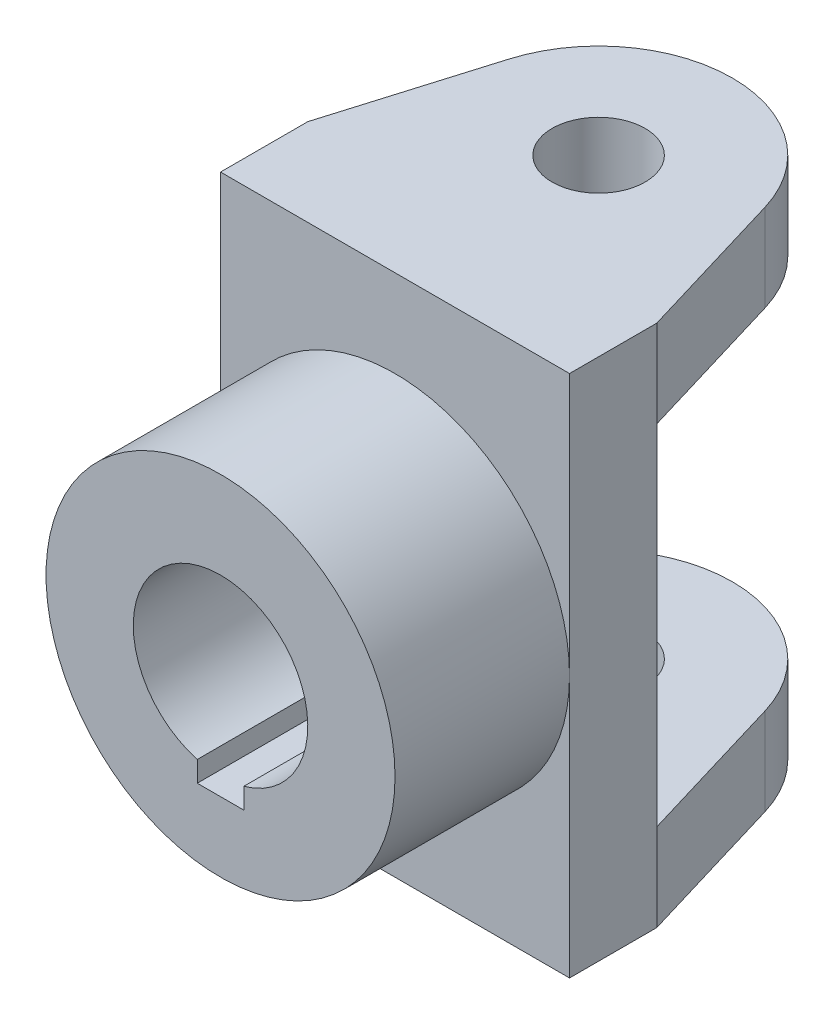
ISO-10303-21;
HEADER;
FILE_DESCRIPTION(('STEP AP214'),'2;1');
FILE_NAME('part.step','',(''),(''),'','','');
FILE_SCHEMA(('AUTOMOTIVE_DESIGN { 1 0 10303 214 1 1 1 1 }'));
ENDSEC;
DATA;
#1=APPLICATION_CONTEXT('core data for automotive mechanical design processes');
#2=APPLICATION_PROTOCOL_DEFINITION('international standard','automotive_design',2000,#1);
#3=PRODUCT_CONTEXT('',#1,'mechanical');
#4=PRODUCT('Part','Part','',(#3));
#5=PRODUCT_RELATED_PRODUCT_CATEGORY('part','',(#4));
#6=PRODUCT_DEFINITION_FORMATION('','',#4);
#7=PRODUCT_DEFINITION_CONTEXT('part definition',#1,'design');
#8=PRODUCT_DEFINITION('design','',#6,#7);
#9=PRODUCT_DEFINITION_SHAPE('','',#8);
#10=(LENGTH_UNIT() NAMED_UNIT(*) SI_UNIT(.MILLI.,.METRE.));
#11=(NAMED_UNIT(*) PLANE_ANGLE_UNIT() SI_UNIT($,.RADIAN.));
#12=(NAMED_UNIT(*) SI_UNIT($,.STERADIAN.) SOLID_ANGLE_UNIT());
#13=UNCERTAINTY_MEASURE_WITH_UNIT(LENGTH_MEASURE(1.E-05),#10,'distance_accuracy_value','');
#14=(GEOMETRIC_REPRESENTATION_CONTEXT(3) GLOBAL_UNCERTAINTY_ASSIGNED_CONTEXT((#13)) GLOBAL_UNIT_ASSIGNED_CONTEXT((#10,
#11,#12)) REPRESENTATION_CONTEXT('',''));
#15=CARTESIAN_POINT('',(0.,0.,0.));
#16=DIRECTION('',(0.,0.,1.));
#17=DIRECTION('',(1.,0.,0.));
#18=AXIS2_PLACEMENT_3D('',#15,#16,#17);
#19=CARTESIAN_POINT('',(0.,0.,0.));
#20=DIRECTION('',(0.,0.,1.));
#21=DIRECTION('',(1.,0.,0.));
#22=AXIS2_PLACEMENT_3D('',#19,#20,#21);
#23=PLANE('',#22);
#24=DIRECTION('',(1.,0.,0.));
#25=VECTOR('',#24,1.);
#26=CARTESIAN_POINT('',(-30.,-30.,0.));
#27=LINE('',#26,#25);
#28=CARTESIAN_POINT('',(-30.,-30.,0.));
#29=VERTEX_POINT('',#28);
#30=CARTESIAN_POINT('',(30.,-30.,0.));
#31=VERTEX_POINT('',#30);
#32=EDGE_CURVE('E156',#29,#31,#27,.T.);
#33=ORIENTED_EDGE('',*,*,#32,.F.);
#34=DIRECTION('',(0.,-1.,0.));
#35=VECTOR('',#34,1.);
#36=CARTESIAN_POINT('',(-30.,45.,0.));
#37=LINE('',#36,#35);
#38=CARTESIAN_POINT('',(-30.,30.,0.));
#39=VERTEX_POINT('',#38);
#40=EDGE_CURVE('E191',#39,#29,#37,.T.);
#41=ORIENTED_EDGE('',*,*,#40,.F.);
#42=DIRECTION('',(1.,0.,0.));
#43=VECTOR('',#42,1.);
#44=CARTESIAN_POINT('',(-30.,30.,0.));
#45=LINE('',#44,#43);
#46=CARTESIAN_POINT('',(30.,30.,0.));
#47=VERTEX_POINT('',#46);
#48=EDGE_CURVE('E182',#39,#47,#45,.T.);
#49=ORIENTED_EDGE('',*,*,#48,.T.);
#50=DIRECTION('',(0.,1.,0.));
#51=VECTOR('',#50,1.);
#52=CARTESIAN_POINT('',(30.,45.,0.));
#53=LINE('',#52,#51);
#54=EDGE_CURVE('E61',#31,#47,#53,.T.);
#55=ORIENTED_EDGE('',*,*,#54,.F.);
#56=EDGE_LOOP('',(#33,#41,#49,#55));
#57=FACE_BOUND('',#56,.T.);
#58=ADVANCED_FACE('F43',(#57),#23,.F.);
#59=CARTESIAN_POINT('',(0.,0.,15.));
#60=DIRECTION('',(0.,0.,1.));
#61=DIRECTION('',(1.,0.,0.));
#62=AXIS2_PLACEMENT_3D('',#59,#60,#61);
#63=PLANE('',#62);
#64=CARTESIAN_POINT('',(0.,0.,15.));
#65=DIRECTION('',(0.,0.,1.));
#66=DIRECTION('',(1.,0.,0.));
#67=AXIS2_PLACEMENT_3D('',#64,#65,#66);
#68=CIRCLE('',#67,30.);
#69=CARTESIAN_POINT('',(30.,0.,15.));
#70=VERTEX_POINT('',#69);
#71=CARTESIAN_POINT('',(-30.,0.,15.));
#72=VERTEX_POINT('',#71);
#73=EDGE_CURVE('E54',#70,#72,#68,.T.);
#74=ORIENTED_EDGE('',*,*,#73,.F.);
#75=DIRECTION('',(0.,1.,0.));
#76=VECTOR('',#75,1.);
#77=CARTESIAN_POINT('',(30.,45.,15.));
#78=LINE('',#77,#76);
#79=CARTESIAN_POINT('',(30.,45.,15.));
#80=VERTEX_POINT('',#79);
#81=EDGE_CURVE('E201',#70,#80,#78,.T.);
#82=ORIENTED_EDGE('',*,*,#81,.T.);
#83=DIRECTION('',(-1.,0.,0.));
#84=VECTOR('',#83,1.);
#85=CARTESIAN_POINT('',(-30.,45.,15.));
#86=LINE('',#85,#84);
#87=CARTESIAN_POINT('',(-30.,45.,15.));
#88=VERTEX_POINT('',#87);
#89=EDGE_CURVE('E223',#80,#88,#86,.T.);
#90=ORIENTED_EDGE('',*,*,#89,.T.);
#91=DIRECTION('',(0.,-1.,0.));
#92=VECTOR('',#91,1.);
#93=CARTESIAN_POINT('',(-30.,45.,15.));
#94=LINE('',#93,#92);
#95=EDGE_CURVE('E293',#88,#72,#94,.T.);
#96=ORIENTED_EDGE('',*,*,#95,.T.);
#97=EDGE_LOOP('',(#74,#82,#90,#96));
#98=FACE_BOUND('',#97,.T.);
#99=ADVANCED_FACE('F384',(#98),#63,.T.);
#100=CARTESIAN_POINT('',(30.,45.,15.));
#101=DIRECTION('',(-1.,0.,0.));
#102=DIRECTION('',(0.,-1.,0.));
#103=AXIS2_PLACEMENT_3D('',#100,#101,#102);
#104=PLANE('',#103);
#105=CARTESIAN_POINT('',(30.,-45.,0.));
#106=VERTEX_POINT('',#105);
#107=EDGE_CURVE('E173',#106,#31,#53,.T.);
#108=ORIENTED_EDGE('',*,*,#107,.T.);
#109=ORIENTED_EDGE('',*,*,#54,.T.);
#110=DIRECTION('',(0.,1.,0.));
#111=VECTOR('',#110,1.);
#112=CARTESIAN_POINT('',(30.,30.,0.));
#113=LINE('',#112,#111);
#114=CARTESIAN_POINT('',(30.,45.,0.));
#115=VERTEX_POINT('',#114);
#116=EDGE_CURVE('E227',#47,#115,#113,.T.);
#117=ORIENTED_EDGE('',*,*,#116,.T.);
#118=DIRECTION('',(0.,0.,-1.));
#119=VECTOR('',#118,1.);
#120=CARTESIAN_POINT('',(30.,45.,15.));
#121=LINE('',#120,#119);
#122=EDGE_CURVE('E47',#80,#115,#121,.T.);
#123=ORIENTED_EDGE('',*,*,#122,.F.);
#124=ORIENTED_EDGE('',*,*,#81,.F.);
#125=CARTESIAN_POINT('',(30.,-45.,15.));
#126=VERTEX_POINT('',#125);
#127=EDGE_CURVE('E288',#126,#70,#78,.T.);
#128=ORIENTED_EDGE('',*,*,#127,.F.);
#129=DIRECTION('',(0.,0.,-1.));
#130=VECTOR('',#129,1.);
#131=CARTESIAN_POINT('',(30.,-45.,15.));
#132=LINE('',#131,#130);
#133=EDGE_CURVE('E189',#126,#106,#132,.T.);
#134=ORIENTED_EDGE('',*,*,#133,.T.);
#135=EDGE_LOOP('',(#108,#109,#117,#123,#124,#128,#134));
#136=FACE_BOUND('',#135,.T.);
#137=ADVANCED_FACE('F45',(#136),#104,.F.);
#138=CARTESIAN_POINT('',(-30.,45.,15.));
#139=DIRECTION('',(0.,-1.,0.));
#140=DIRECTION('',(0.,0.,-1.));
#141=AXIS2_PLACEMENT_3D('',#138,#139,#140);
#142=PLANE('',#141);
#143=ORIENTED_EDGE('',*,*,#122,.T.);
#144=DIRECTION('',(-0.286928155857607,0.,-0.957952103905071));
#145=VECTOR('',#144,1.);
#146=CARTESIAN_POINT('',(30.,45.,0.));
#147=LINE('',#146,#145);
#148=CARTESIAN_POINT('',(22.0328983898167,45.,-26.599347584725));
#149=VERTEX_POINT('',#148);
#150=EDGE_CURVE('E222',#115,#149,#147,.T.);
#151=ORIENTED_EDGE('',*,*,#150,.T.);
#152=CARTESIAN_POINT('',(0.,45.,-20.));
#153=DIRECTION('',(0.,1.,0.));
#154=DIRECTION('',(0.,0.,1.));
#155=AXIS2_PLACEMENT_3D('',#152,#153,#154);
#156=CIRCLE('',#155,23.);
#157=CARTESIAN_POINT('',(-22.0328983898166,45.,-26.599347584725));
#158=VERTEX_POINT('',#157);
#159=EDGE_CURVE('E357',#149,#158,#156,.T.);
#160=ORIENTED_EDGE('',*,*,#159,.T.);
#161=DIRECTION('',(-0.286928155857607,0.,0.957952103905071));
#162=VECTOR('',#161,1.);
#163=CARTESIAN_POINT('',(-30.,45.,0.));
#164=LINE('',#163,#162);
#165=CARTESIAN_POINT('',(-30.,45.,0.));
#166=VERTEX_POINT('',#165);
#167=EDGE_CURVE('E242',#158,#166,#164,.T.);
#168=ORIENTED_EDGE('',*,*,#167,.T.);
#169=DIRECTION('',(0.,0.,-1.));
#170=VECTOR('',#169,1.);
#171=CARTESIAN_POINT('',(-30.,45.,15.));
#172=LINE('',#171,#170);
#173=EDGE_CURVE('E207',#88,#166,#172,.T.);
#174=ORIENTED_EDGE('',*,*,#173,.F.);
#175=ORIENTED_EDGE('',*,*,#89,.F.);
#176=EDGE_LOOP('',(#143,#151,#160,#168,#174,#175));
#177=FACE_BOUND('',#176,.T.);
#178=CARTESIAN_POINT('',(0.,45.,-20.));
#179=DIRECTION('',(0.,1.,0.));
#180=DIRECTION('',(0.,0.,1.));
#181=AXIS2_PLACEMENT_3D('',#178,#179,#180);
#182=CIRCLE('',#181,8.);
#183=CARTESIAN_POINT('',(0.,45.,-12.));
#184=VERTEX_POINT('',#183);
#185=EDGE_CURVE('E330',#184,#184,#182,.T.);
#186=ORIENTED_EDGE('',*,*,#185,.F.);
#187=EDGE_LOOP('',(#186));
#188=FACE_BOUND('',#187,.T.);
#189=ADVANCED_FACE('F219',(#177,#188),#142,.F.);
#190=CARTESIAN_POINT('',(-30.,45.,15.));
#191=DIRECTION('',(1.,0.,0.));
#192=DIRECTION('',(0.,1.,0.));
#193=AXIS2_PLACEMENT_3D('',#190,#191,#192);
#194=PLANE('',#193);
#195=EDGE_CURVE('E193',#166,#39,#37,.T.);
#196=ORIENTED_EDGE('',*,*,#195,.T.);
#197=ORIENTED_EDGE('',*,*,#40,.T.);
#198=DIRECTION('',(0.,-1.,0.));
#199=VECTOR('',#198,1.);
#200=CARTESIAN_POINT('',(-30.,-30.,0.));
#201=LINE('',#200,#199);
#202=CARTESIAN_POINT('',(-30.,-45.,0.));
#203=VERTEX_POINT('',#202);
#204=EDGE_CURVE('E306',#29,#203,#201,.T.);
#205=ORIENTED_EDGE('',*,*,#204,.T.);
#206=DIRECTION('',(0.,0.,-1.));
#207=VECTOR('',#206,1.);
#208=CARTESIAN_POINT('',(-30.,-45.,15.));
#209=LINE('',#208,#207);
#210=CARTESIAN_POINT('',(-30.,-45.,15.));
#211=VERTEX_POINT('',#210);
#212=EDGE_CURVE('E204',#211,#203,#209,.T.);
#213=ORIENTED_EDGE('',*,*,#212,.F.);
#214=EDGE_CURVE('E292',#72,#211,#94,.T.);
#215=ORIENTED_EDGE('',*,*,#214,.F.);
#216=ORIENTED_EDGE('',*,*,#95,.F.);
#217=ORIENTED_EDGE('',*,*,#173,.T.);
#218=EDGE_LOOP('',(#196,#197,#205,#213,#215,#216,#217));
#219=FACE_BOUND('',#218,.T.);
#220=ADVANCED_FACE('F305',(#219),#194,.F.);
#221=CARTESIAN_POINT('',(-30.,-45.,15.));
#222=DIRECTION('',(0.,1.,0.));
#223=DIRECTION('',(0.,0.,1.));
#224=AXIS2_PLACEMENT_3D('',#221,#222,#223);
#225=PLANE('',#224);
#226=ORIENTED_EDGE('',*,*,#212,.T.);
#227=DIRECTION('',(-0.286928155857607,0.,0.957952103905071));
#228=VECTOR('',#227,1.);
#229=CARTESIAN_POINT('',(-30.,-45.,0.));
#230=LINE('',#229,#228);
#231=CARTESIAN_POINT('',(-22.0328983898166,-45.,-26.599347584725));
#232=VERTEX_POINT('',#231);
#233=EDGE_CURVE('E313',#232,#203,#230,.T.);
#234=ORIENTED_EDGE('',*,*,#233,.F.);
#235=CARTESIAN_POINT('',(0.,-45.,-20.));
#236=DIRECTION('',(0.,1.,0.));
#237=DIRECTION('',(0.,0.,1.));
#238=AXIS2_PLACEMENT_3D('',#235,#236,#237);
#239=CIRCLE('',#238,23.);
#240=CARTESIAN_POINT('',(22.0328983898167,-45.,-26.599347584725));
#241=VERTEX_POINT('',#240);
#242=EDGE_CURVE('E178',#241,#232,#239,.T.);
#243=ORIENTED_EDGE('',*,*,#242,.F.);
#244=DIRECTION('',(-0.286928155857607,0.,-0.957952103905071));
#245=VECTOR('',#244,1.);
#246=CARTESIAN_POINT('',(30.,-45.,0.));
#247=LINE('',#246,#245);
#248=EDGE_CURVE('E311',#106,#241,#247,.T.);
#249=ORIENTED_EDGE('',*,*,#248,.F.);
#250=ORIENTED_EDGE('',*,*,#133,.F.);
#251=DIRECTION('',(1.,0.,0.));
#252=VECTOR('',#251,1.);
#253=CARTESIAN_POINT('',(-30.,-45.,15.));
#254=LINE('',#253,#252);
#255=EDGE_CURVE('E196',#211,#126,#254,.T.);
#256=ORIENTED_EDGE('',*,*,#255,.F.);
#257=EDGE_LOOP('',(#226,#234,#243,#249,#250,#256));
#258=FACE_BOUND('',#257,.T.);
#259=CARTESIAN_POINT('',(0.,-45.,-20.));
#260=DIRECTION('',(0.,1.,0.));
#261=DIRECTION('',(0.,0.,1.));
#262=AXIS2_PLACEMENT_3D('',#259,#260,#261);
#263=CIRCLE('',#262,8.);
#264=CARTESIAN_POINT('',(0.,-45.,-12.));
#265=VERTEX_POINT('',#264);
#266=EDGE_CURVE('E320',#265,#265,#263,.T.);
#267=ORIENTED_EDGE('',*,*,#266,.T.);
#268=EDGE_LOOP('',(#267));
#269=FACE_BOUND('',#268,.T.);
#270=ADVANCED_FACE('F309',(#258,#269),#225,.F.);
#271=EDGE_CURVE('E11',#72,#70,#68,.T.);
#272=ORIENTED_EDGE('',*,*,#271,.F.);
#273=ORIENTED_EDGE('',*,*,#214,.T.);
#274=ORIENTED_EDGE('',*,*,#255,.T.);
#275=ORIENTED_EDGE('',*,*,#127,.T.);
#276=EDGE_LOOP('',(#272,#273,#274,#275));
#277=FACE_BOUND('',#276,.T.);
#278=ADVANCED_FACE('F302',(#277),#63,.T.);
#279=CARTESIAN_POINT('',(0.,0.,45.));
#280=DIRECTION('',(0.,0.,1.));
#281=DIRECTION('',(1.,0.,0.));
#282=AXIS2_PLACEMENT_3D('',#279,#280,#281);
#283=PLANE('',#282);
#284=CARTESIAN_POINT('',(0.,0.,45.));
#285=DIRECTION('',(0.,0.,1.));
#286=DIRECTION('',(1.,0.,0.));
#287=AXIS2_PLACEMENT_3D('',#284,#285,#286);
#288=CIRCLE('',#287,30.);
#289=CARTESIAN_POINT('',(30.,0.,45.));
#290=VERTEX_POINT('',#289);
#291=EDGE_CURVE('E184',#290,#290,#288,.T.);
#292=ORIENTED_EDGE('',*,*,#291,.T.);
#293=EDGE_LOOP('',(#292));
#294=FACE_BOUND('',#293,.T.);
#295=DIRECTION('',(0.,1.,0.));
#296=VECTOR('',#295,1.);
#297=CARTESIAN_POINT('',(4.,-14.456832294801,45.));
#298=LINE('',#297,#296);
#299=CARTESIAN_POINT('',(4.,-18.,45.));
#300=VERTEX_POINT('',#299);
#301=CARTESIAN_POINT('',(4.,-14.456832294801,45.));
#302=VERTEX_POINT('',#301);
#303=EDGE_CURVE('E250',#300,#302,#298,.T.);
#304=ORIENTED_EDGE('',*,*,#303,.F.);
#305=DIRECTION('',(1.,0.,0.));
#306=VECTOR('',#305,1.);
#307=CARTESIAN_POINT('',(-4.,-18.,45.));
#308=LINE('',#307,#306);
#309=CARTESIAN_POINT('',(-4.,-18.,45.));
#310=VERTEX_POINT('',#309);
#311=EDGE_CURVE('E247',#310,#300,#308,.T.);
#312=ORIENTED_EDGE('',*,*,#311,.F.);
#313=DIRECTION('',(0.,-1.,0.));
#314=VECTOR('',#313,1.);
#315=CARTESIAN_POINT('',(-4.,-14.456832294801,45.));
#316=LINE('',#315,#314);
#317=CARTESIAN_POINT('',(-4.,-14.456832294801,45.));
#318=VERTEX_POINT('',#317);
#319=EDGE_CURVE('E258',#318,#310,#316,.T.);
#320=ORIENTED_EDGE('',*,*,#319,.F.);
#321=CARTESIAN_POINT('',(0.,0.,45.));
#322=DIRECTION('',(0.,0.,1.));
#323=DIRECTION('',(1.,0.,0.));
#324=AXIS2_PLACEMENT_3D('',#321,#322,#323);
#325=CIRCLE('',#324,15.);
#326=EDGE_CURVE('E254',#302,#318,#325,.T.);
#327=ORIENTED_EDGE('',*,*,#326,.F.);
#328=EDGE_LOOP('',(#304,#312,#320,#327));
#329=FACE_BOUND('',#328,.T.);
#330=ADVANCED_FACE('F418',(#294,#329),#283,.T.);
#331=CARTESIAN_POINT('',(0.,0.,45.));
#332=DIRECTION('',(0.,0.,-1.));
#333=DIRECTION('',(-1.,0.,0.));
#334=AXIS2_PLACEMENT_3D('',#331,#332,#333);
#335=CYLINDRICAL_SURFACE('',#334,30.);
#336=ORIENTED_EDGE('',*,*,#291,.F.);
#337=EDGE_LOOP('',(#336));
#338=FACE_BOUND('',#337,.T.);
#339=ORIENTED_EDGE('',*,*,#73,.T.);
#340=ORIENTED_EDGE('',*,*,#271,.T.);
#341=EDGE_LOOP('',(#339,#340));
#342=FACE_BOUND('',#341,.T.);
#343=ADVANCED_FACE('F426',(#338,#342),#335,.T.);
#344=CARTESIAN_POINT('',(-4.,-18.,45.));
#345=DIRECTION('',(0.,1.,0.));
#346=DIRECTION('',(0.,0.,1.));
#347=AXIS2_PLACEMENT_3D('',#344,#345,#346);
#348=PLANE('',#347);
#349=DIRECTION('',(1.,0.,0.));
#350=VECTOR('',#349,1.);
#351=CARTESIAN_POINT('',(-4.,-18.,15.));
#352=LINE('',#351,#350);
#353=CARTESIAN_POINT('',(-4.,-18.,15.));
#354=VERTEX_POINT('',#353);
#355=CARTESIAN_POINT('',(4.,-18.,15.));
#356=VERTEX_POINT('',#355);
#357=EDGE_CURVE('E231',#354,#356,#352,.T.);
#358=ORIENTED_EDGE('',*,*,#357,.F.);
#359=DIRECTION('',(0.,0.,-1.));
#360=VECTOR('',#359,1.);
#361=CARTESIAN_POINT('',(-4.,-18.,45.));
#362=LINE('',#361,#360);
#363=EDGE_CURVE('E69',#310,#354,#362,.T.);
#364=ORIENTED_EDGE('',*,*,#363,.F.);
#365=ORIENTED_EDGE('',*,*,#311,.T.);
#366=DIRECTION('',(0.,0.,-1.));
#367=VECTOR('',#366,1.);
#368=CARTESIAN_POINT('',(4.,-18.,45.));
#369=LINE('',#368,#367);
#370=EDGE_CURVE('E279',#300,#356,#369,.T.);
#371=ORIENTED_EDGE('',*,*,#370,.T.);
#372=EDGE_LOOP('',(#358,#364,#365,#371));
#373=FACE_BOUND('',#372,.T.);
#374=ADVANCED_FACE('F436',(#373),#348,.T.);
#375=CARTESIAN_POINT('',(4.,-14.456832294801,45.));
#376=DIRECTION('',(-1.,0.,0.));
#377=DIRECTION('',(0.,-1.,0.));
#378=AXIS2_PLACEMENT_3D('',#375,#376,#377);
#379=PLANE('',#378);
#380=DIRECTION('',(0.,1.,0.));
#381=VECTOR('',#380,1.);
#382=CARTESIAN_POINT('',(4.,-14.456832294801,15.));
#383=LINE('',#382,#381);
#384=CARTESIAN_POINT('',(4.,-14.456832294801,15.));
#385=VERTEX_POINT('',#384);
#386=EDGE_CURVE('E237',#356,#385,#383,.T.);
#387=ORIENTED_EDGE('',*,*,#386,.F.);
#388=ORIENTED_EDGE('',*,*,#370,.F.);
#389=ORIENTED_EDGE('',*,*,#303,.T.);
#390=DIRECTION('',(0.,0.,-1.));
#391=VECTOR('',#390,1.);
#392=CARTESIAN_POINT('',(4.,-14.456832294801,45.));
#393=LINE('',#392,#391);
#394=EDGE_CURVE('E276',#302,#385,#393,.T.);
#395=ORIENTED_EDGE('',*,*,#394,.T.);
#396=EDGE_LOOP('',(#387,#388,#389,#395));
#397=FACE_BOUND('',#396,.T.);
#398=ADVANCED_FACE('F445',(#397),#379,.T.);
#399=CARTESIAN_POINT('',(0.,0.,45.));
#400=DIRECTION('',(0.,0.,-1.));
#401=DIRECTION('',(-1.,0.,0.));
#402=AXIS2_PLACEMENT_3D('',#399,#400,#401);
#403=CYLINDRICAL_SURFACE('',#402,15.);
#404=CARTESIAN_POINT('',(0.,0.,15.));
#405=DIRECTION('',(0.,0.,1.));
#406=DIRECTION('',(1.,0.,0.));
#407=AXIS2_PLACEMENT_3D('',#404,#405,#406);
#408=CIRCLE('',#407,15.);
#409=CARTESIAN_POINT('',(-4.,-14.456832294801,15.));
#410=VERTEX_POINT('',#409);
#411=EDGE_CURVE('E264',#385,#410,#408,.T.);
#412=ORIENTED_EDGE('',*,*,#411,.F.);
#413=ORIENTED_EDGE('',*,*,#394,.F.);
#414=ORIENTED_EDGE('',*,*,#326,.T.);
#415=DIRECTION('',(0.,0.,-1.));
#416=VECTOR('',#415,1.);
#417=CARTESIAN_POINT('',(-4.,-14.456832294801,45.));
#418=LINE('',#417,#416);
#419=EDGE_CURVE('E273',#318,#410,#418,.T.);
#420=ORIENTED_EDGE('',*,*,#419,.T.);
#421=EDGE_LOOP('',(#412,#413,#414,#420));
#422=FACE_BOUND('',#421,.T.);
#423=ADVANCED_FACE('F455',(#422),#403,.F.);
#424=CARTESIAN_POINT('',(-4.,-14.456832294801,45.));
#425=DIRECTION('',(1.,0.,0.));
#426=DIRECTION('',(0.,1.,0.));
#427=AXIS2_PLACEMENT_3D('',#424,#425,#426);
#428=PLANE('',#427);
#429=DIRECTION('',(0.,-1.,0.));
#430=VECTOR('',#429,1.);
#431=CARTESIAN_POINT('',(-4.,-14.456832294801,15.));
#432=LINE('',#431,#430);
#433=EDGE_CURVE('E251',#410,#354,#432,.T.);
#434=ORIENTED_EDGE('',*,*,#433,.F.);
#435=ORIENTED_EDGE('',*,*,#419,.F.);
#436=ORIENTED_EDGE('',*,*,#319,.T.);
#437=ORIENTED_EDGE('',*,*,#363,.T.);
#438=EDGE_LOOP('',(#434,#435,#436,#437));
#439=FACE_BOUND('',#438,.T.);
#440=ADVANCED_FACE('F465',(#439),#428,.T.);
#441=ORIENTED_EDGE('',*,*,#433,.T.);
#442=ORIENTED_EDGE('',*,*,#357,.T.);
#443=ORIENTED_EDGE('',*,*,#386,.T.);
#444=ORIENTED_EDGE('',*,*,#411,.T.);
#445=EDGE_LOOP('',(#441,#442,#443,#444));
#446=FACE_BOUND('',#445,.T.);
#447=ADVANCED_FACE('F390',(#446),#63,.T.);
#448=CARTESIAN_POINT('',(30.,30.,0.));
#449=DIRECTION('',(0.957952103905071,0.,-0.286928155857607));
#450=DIRECTION('',(-0.286928155857607,0.,-0.957952103905071));
#451=AXIS2_PLACEMENT_3D('',#448,#449,#450);
#452=PLANE('',#451);
#453=ORIENTED_EDGE('',*,*,#150,.F.);
#454=ORIENTED_EDGE('',*,*,#116,.F.);
#455=DIRECTION('',(-0.286928155857607,0.,-0.957952103905071));
#456=VECTOR('',#455,1.);
#457=CARTESIAN_POINT('',(30.,30.,0.));
#458=LINE('',#457,#456);
#459=CARTESIAN_POINT('',(22.0328983898167,30.,-26.599347584725));
#460=VERTEX_POINT('',#459);
#461=EDGE_CURVE('E344',#47,#460,#458,.T.);
#462=ORIENTED_EDGE('',*,*,#461,.T.);
#463=DIRECTION('',(0.,1.,0.));
#464=VECTOR('',#463,1.);
#465=CARTESIAN_POINT('',(22.0328983898167,30.,-26.599347584725));
#466=LINE('',#465,#464);
#467=EDGE_CURVE('E239',#460,#149,#466,.T.);
#468=ORIENTED_EDGE('',*,*,#467,.T.);
#469=EDGE_LOOP('',(#453,#454,#462,#468));
#470=FACE_BOUND('',#469,.T.);
#471=ADVANCED_FACE('F369',(#470),#452,.T.);
#472=CARTESIAN_POINT('',(-30.,30.,0.));
#473=DIRECTION('',(-0.957952103905072,0.,-0.286928155857607));
#474=DIRECTION('',(-0.286928155857607,0.,0.957952103905072));
#475=AXIS2_PLACEMENT_3D('',#472,#473,#474);
#476=PLANE('',#475);
#477=ORIENTED_EDGE('',*,*,#167,.F.);
#478=DIRECTION('',(0.,1.,0.));
#479=VECTOR('',#478,1.);
#480=CARTESIAN_POINT('',(-22.0328983898166,30.,-26.599347584725));
#481=LINE('',#480,#479);
#482=CARTESIAN_POINT('',(-22.0328983898166,30.,-26.599347584725));
#483=VERTEX_POINT('',#482);
#484=EDGE_CURVE('E232',#483,#158,#481,.T.);
#485=ORIENTED_EDGE('',*,*,#484,.F.);
#486=DIRECTION('',(-0.286928155857607,0.,0.957952103905071));
#487=VECTOR('',#486,1.);
#488=CARTESIAN_POINT('',(-30.,30.,0.));
#489=LINE('',#488,#487);
#490=EDGE_CURVE('E351',#483,#39,#489,.T.);
#491=ORIENTED_EDGE('',*,*,#490,.T.);
#492=ORIENTED_EDGE('',*,*,#195,.F.);
#493=EDGE_LOOP('',(#477,#485,#491,#492));
#494=FACE_BOUND('',#493,.T.);
#495=ADVANCED_FACE('F364',(#494),#476,.T.);
#496=CARTESIAN_POINT('',(0.,30.,-20.));
#497=DIRECTION('',(0.,1.,0.));
#498=DIRECTION('',(0.,0.,1.));
#499=AXIS2_PLACEMENT_3D('',#496,#497,#498);
#500=CYLINDRICAL_SURFACE('',#499,23.);
#501=ORIENTED_EDGE('',*,*,#159,.F.);
#502=ORIENTED_EDGE('',*,*,#467,.F.);
#503=CARTESIAN_POINT('',(0.,30.,-20.));
#504=DIRECTION('',(0.,1.,0.));
#505=DIRECTION('',(0.,0.,1.));
#506=AXIS2_PLACEMENT_3D('',#503,#504,#505);
#507=CIRCLE('',#506,23.);
#508=EDGE_CURVE('E347',#460,#483,#507,.T.);
#509=ORIENTED_EDGE('',*,*,#508,.T.);
#510=ORIENTED_EDGE('',*,*,#484,.T.);
#511=EDGE_LOOP('',(#501,#502,#509,#510));
#512=FACE_BOUND('',#511,.T.);
#513=ADVANCED_FACE('F371',(#512),#500,.T.);
#514=CARTESIAN_POINT('',(0.,30.,-20.));
#515=DIRECTION('',(0.,1.,0.));
#516=DIRECTION('',(0.,0.,1.));
#517=AXIS2_PLACEMENT_3D('',#514,#515,#516);
#518=PLANE('',#517);
#519=CARTESIAN_POINT('',(0.,30.,-20.));
#520=DIRECTION('',(0.,1.,0.));
#521=DIRECTION('',(0.,0.,1.));
#522=AXIS2_PLACEMENT_3D('',#519,#520,#521);
#523=CIRCLE('',#522,8.);
#524=CARTESIAN_POINT('',(0.,30.,-12.));
#525=VERTEX_POINT('',#524);
#526=EDGE_CURVE('E337',#525,#525,#523,.T.);
#527=ORIENTED_EDGE('',*,*,#526,.T.);
#528=EDGE_LOOP('',(#527));
#529=FACE_BOUND('',#528,.T.);
#530=ORIENTED_EDGE('',*,*,#461,.F.);
#531=ORIENTED_EDGE('',*,*,#48,.F.);
#532=ORIENTED_EDGE('',*,*,#490,.F.);
#533=ORIENTED_EDGE('',*,*,#508,.F.);
#534=EDGE_LOOP('',(#530,#531,#532,#533));
#535=FACE_BOUND('',#534,.T.);
#536=ADVANCED_FACE('F368',(#529,#535),#518,.F.);
#537=CARTESIAN_POINT('',(0.,30.,-20.));
#538=DIRECTION('',(0.,1.,0.));
#539=DIRECTION('',(0.,0.,1.));
#540=AXIS2_PLACEMENT_3D('',#537,#538,#539);
#541=CYLINDRICAL_SURFACE('',#540,8.);
#542=ORIENTED_EDGE('',*,*,#526,.F.);
#543=EDGE_LOOP('',(#542));
#544=FACE_BOUND('',#543,.T.);
#545=ORIENTED_EDGE('',*,*,#185,.T.);
#546=EDGE_LOOP('',(#545));
#547=FACE_BOUND('',#546,.T.);
#548=ADVANCED_FACE('F378',(#544,#547),#541,.F.);
#549=CARTESIAN_POINT('',(0.,-30.,-20.));
#550=DIRECTION('',(0.,-1.,0.));
#551=DIRECTION('',(0.,0.,1.));
#552=AXIS2_PLACEMENT_3D('',#549,#550,#551);
#553=PLANE('',#552);
#554=DIRECTION('',(-0.286928155857607,0.,-0.957952103905071));
#555=VECTOR('',#554,1.);
#556=CARTESIAN_POINT('',(30.,-30.,0.));
#557=LINE('',#556,#555);
#558=CARTESIAN_POINT('',(22.0328983898167,-30.,-26.599347584725));
#559=VERTEX_POINT('',#558);
#560=EDGE_CURVE('E160',#31,#559,#557,.T.);
#561=ORIENTED_EDGE('',*,*,#560,.T.);
#562=CARTESIAN_POINT('',(0.,-30.,-20.));
#563=DIRECTION('',(0.,1.,0.));
#564=DIRECTION('',(0.,0.,1.));
#565=AXIS2_PLACEMENT_3D('',#562,#563,#564);
#566=CIRCLE('',#565,23.);
#567=CARTESIAN_POINT('',(-22.0328983898166,-30.,-26.599347584725));
#568=VERTEX_POINT('',#567);
#569=EDGE_CURVE('E323',#559,#568,#566,.T.);
#570=ORIENTED_EDGE('',*,*,#569,.T.);
#571=DIRECTION('',(-0.286928155857607,0.,0.957952103905071));
#572=VECTOR('',#571,1.);
#573=CARTESIAN_POINT('',(-30.,-30.,0.));
#574=LINE('',#573,#572);
#575=EDGE_CURVE('E163',#568,#29,#574,.T.);
#576=ORIENTED_EDGE('',*,*,#575,.T.);
#577=ORIENTED_EDGE('',*,*,#32,.T.);
#578=EDGE_LOOP('',(#561,#570,#576,#577));
#579=FACE_BOUND('',#578,.T.);
#580=CARTESIAN_POINT('',(0.,-30.,-20.));
#581=DIRECTION('',(0.,1.,0.));
#582=DIRECTION('',(0.,0.,1.));
#583=AXIS2_PLACEMENT_3D('',#580,#581,#582);
#584=CIRCLE('',#583,8.);
#585=CARTESIAN_POINT('',(0.,-30.,-12.));
#586=VERTEX_POINT('',#585);
#587=EDGE_CURVE('E314',#586,#586,#584,.T.);
#588=ORIENTED_EDGE('',*,*,#587,.F.);
#589=EDGE_LOOP('',(#588));
#590=FACE_BOUND('',#589,.T.);
#591=ADVANCED_FACE('F158',(#579,#590),#553,.F.);
#592=CARTESIAN_POINT('',(30.,-30.,0.));
#593=DIRECTION('',(-0.957952103905071,0.,0.286928155857607));
#594=DIRECTION('',(0.286928155857607,0.,0.957952103905071));
#595=AXIS2_PLACEMENT_3D('',#592,#593,#594);
#596=PLANE('',#595);
#597=ORIENTED_EDGE('',*,*,#248,.T.);
#598=DIRECTION('',(0.,-1.,0.));
#599=VECTOR('',#598,1.);
#600=CARTESIAN_POINT('',(22.0328983898167,-30.,-26.599347584725));
#601=LINE('',#600,#599);
#602=EDGE_CURVE('E176',#559,#241,#601,.T.);
#603=ORIENTED_EDGE('',*,*,#602,.F.);
#604=ORIENTED_EDGE('',*,*,#560,.F.);
#605=ORIENTED_EDGE('',*,*,#107,.F.);
#606=EDGE_LOOP('',(#597,#603,#604,#605));
#607=FACE_BOUND('',#606,.T.);
#608=ADVANCED_FACE('F172',(#607),#596,.F.);
#609=CARTESIAN_POINT('',(0.,-30.,-20.));
#610=DIRECTION('',(0.,-1.,0.));
#611=DIRECTION('',(0.,0.,-1.));
#612=AXIS2_PLACEMENT_3D('',#609,#610,#611);
#613=CYLINDRICAL_SURFACE('',#612,23.);
#614=ORIENTED_EDGE('',*,*,#242,.T.);
#615=DIRECTION('',(0.,-1.,0.));
#616=VECTOR('',#615,1.);
#617=CARTESIAN_POINT('',(-22.0328983898166,-30.,-26.599347584725));
#618=LINE('',#617,#616);
#619=EDGE_CURVE('E331',#568,#232,#618,.T.);
#620=ORIENTED_EDGE('',*,*,#619,.F.);
#621=ORIENTED_EDGE('',*,*,#569,.F.);
#622=ORIENTED_EDGE('',*,*,#602,.T.);
#623=EDGE_LOOP('',(#614,#620,#621,#622));
#624=FACE_BOUND('',#623,.T.);
#625=ADVANCED_FACE('F547',(#624),#613,.T.);
#626=CARTESIAN_POINT('',(-30.,-30.,0.));
#627=DIRECTION('',(0.957952103905072,0.,0.286928155857607));
#628=DIRECTION('',(0.286928155857607,0.,-0.957952103905072));
#629=AXIS2_PLACEMENT_3D('',#626,#627,#628);
#630=PLANE('',#629);
#631=ORIENTED_EDGE('',*,*,#233,.T.);
#632=ORIENTED_EDGE('',*,*,#204,.F.);
#633=ORIENTED_EDGE('',*,*,#575,.F.);
#634=ORIENTED_EDGE('',*,*,#619,.T.);
#635=EDGE_LOOP('',(#631,#632,#633,#634));
#636=FACE_BOUND('',#635,.T.);
#637=ADVANCED_FACE('F555',(#636),#630,.F.);
#638=CARTESIAN_POINT('',(0.,-30.,-20.));
#639=DIRECTION('',(0.,-1.,0.));
#640=DIRECTION('',(0.,0.,-1.));
#641=AXIS2_PLACEMENT_3D('',#638,#639,#640);
#642=CYLINDRICAL_SURFACE('',#641,8.);
#643=ORIENTED_EDGE('',*,*,#587,.T.);
#644=EDGE_LOOP('',(#643));
#645=FACE_BOUND('',#644,.T.);
#646=ORIENTED_EDGE('',*,*,#266,.F.);
#647=EDGE_LOOP('',(#646));
#648=FACE_BOUND('',#647,.T.);
#649=ADVANCED_FACE('F564',(#645,#648),#642,.F.);
#650=CLOSED_SHELL('',(#58,#99,#137,#189,#220,#270,#278,#330,#343,#374,#398,#423,#440,#447,#471,
#495,#513,#536,#548,#591,#608,#625,#637,#649));
#651=MANIFOLD_SOLID_BREP('B2',#650);
#652=ADVANCED_BREP_SHAPE_REPRESENTATION('',(#18,#651),#14);
#653=SHAPE_DEFINITION_REPRESENTATION(#9,#652);
ENDSEC;
END-ISO-10303-21;
